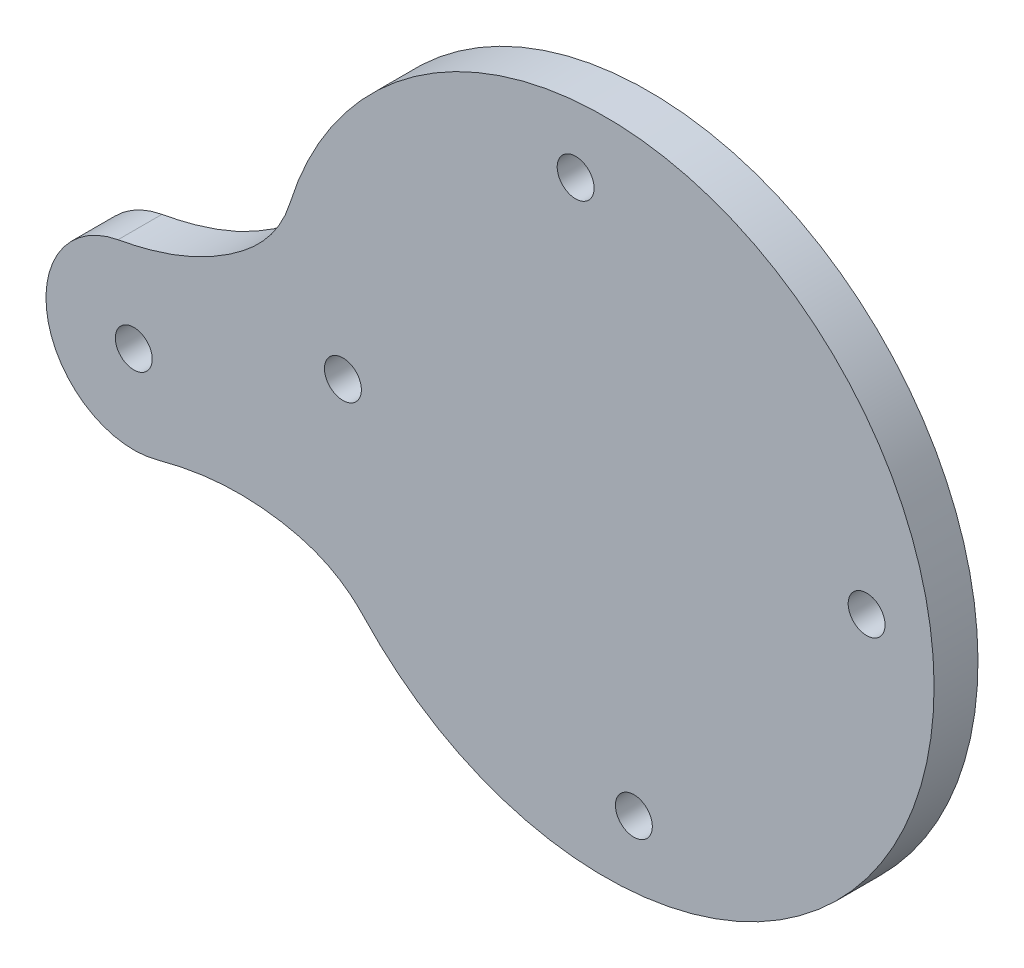
ISO-10303-21;
HEADER;
FILE_DESCRIPTION(('STEP AP214'),'2;1');
FILE_NAME('part.step','',(''),(''),'','','');
FILE_SCHEMA(('AUTOMOTIVE_DESIGN { 1 0 10303 214 1 1 1 1 }'));
ENDSEC;
DATA;
#1=APPLICATION_CONTEXT('core data for automotive mechanical design processes');
#2=APPLICATION_PROTOCOL_DEFINITION('international standard','automotive_design',2000,#1);
#3=PRODUCT_CONTEXT('',#1,'mechanical');
#4=PRODUCT('Part','Part','',(#3));
#5=PRODUCT_RELATED_PRODUCT_CATEGORY('part','',(#4));
#6=PRODUCT_DEFINITION_FORMATION('','',#4);
#7=PRODUCT_DEFINITION_CONTEXT('part definition',#1,'design');
#8=PRODUCT_DEFINITION('design','',#6,#7);
#9=PRODUCT_DEFINITION_SHAPE('','',#8);
#10=(LENGTH_UNIT() NAMED_UNIT(*) SI_UNIT(.MILLI.,.METRE.));
#11=(NAMED_UNIT(*) PLANE_ANGLE_UNIT() SI_UNIT($,.RADIAN.));
#12=(NAMED_UNIT(*) SI_UNIT($,.STERADIAN.) SOLID_ANGLE_UNIT());
#13=UNCERTAINTY_MEASURE_WITH_UNIT(LENGTH_MEASURE(1.E-05),#10,'distance_accuracy_value','');
#14=(GEOMETRIC_REPRESENTATION_CONTEXT(3) GLOBAL_UNCERTAINTY_ASSIGNED_CONTEXT((#13)) GLOBAL_UNIT_ASSIGNED_CONTEXT((#10,
#11,#12)) REPRESENTATION_CONTEXT('',''));
#15=CARTESIAN_POINT('',(0.,0.,0.));
#16=DIRECTION('',(0.,0.,1.));
#17=DIRECTION('',(1.,0.,0.));
#18=AXIS2_PLACEMENT_3D('',#15,#16,#17);
#19=CARTESIAN_POINT('',(0.,0.,5.));
#20=DIRECTION('',(0.,0.,-1.));
#21=DIRECTION('',(-1.,0.,0.));
#22=AXIS2_PLACEMENT_3D('',#19,#20,#21);
#23=CYLINDRICAL_SURFACE('',#22,37.5);
#24=DIRECTION('',(0.,0.,1.));
#25=VECTOR('',#24,1.);
#26=CARTESIAN_POINT('',(-27.4789036897266,-25.5178339992001,0.));
#27=LINE('',#26,#25);
#28=CARTESIAN_POINT('',(-27.4789036897266,-25.5178339992001,0.));
#29=VERTEX_POINT('',#28);
#30=CARTESIAN_POINT('',(-27.4789036897266,-25.5178339992001,5.));
#31=VERTEX_POINT('',#30);
#32=EDGE_CURVE('E77',#29,#31,#27,.T.);
#33=ORIENTED_EDGE('',*,*,#32,.F.);
#34=CARTESIAN_POINT('',(0.,0.,0.));
#35=DIRECTION('',(0.,0.,1.));
#36=DIRECTION('',(1.,0.,0.));
#37=AXIS2_PLACEMENT_3D('',#34,#35,#36);
#38=CIRCLE('',#37,37.5);
#39=CARTESIAN_POINT('',(-35.8163197815048,11.1104112124166,0.));
#40=VERTEX_POINT('',#39);
#41=EDGE_CURVE('E35',#29,#40,#38,.T.);
#42=ORIENTED_EDGE('',*,*,#41,.T.);
#43=DIRECTION('',(0.,0.,1.));
#44=VECTOR('',#43,1.);
#45=CARTESIAN_POINT('',(-35.8163197815048,11.1104112124166,0.));
#46=LINE('',#45,#44);
#47=CARTESIAN_POINT('',(-35.8163197815048,11.1104112124166,5.));
#48=VERTEX_POINT('',#47);
#49=EDGE_CURVE('E49',#40,#48,#46,.T.);
#50=ORIENTED_EDGE('',*,*,#49,.T.);
#51=CARTESIAN_POINT('',(0.,0.,5.));
#52=DIRECTION('',(0.,0.,1.));
#53=DIRECTION('',(1.,0.,0.));
#54=AXIS2_PLACEMENT_3D('',#51,#52,#53);
#55=CIRCLE('',#54,37.5);
#56=EDGE_CURVE('E11',#31,#48,#55,.T.);
#57=ORIENTED_EDGE('',*,*,#56,.F.);
#58=EDGE_LOOP('',(#33,#42,#50,#57));
#59=FACE_BOUND('',#58,.T.);
#60=ADVANCED_FACE('F32',(#59),#23,.T.);
#61=CARTESIAN_POINT('',(0.,0.,5.));
#62=DIRECTION('',(0.,0.,1.));
#63=DIRECTION('',(1.,0.,0.));
#64=AXIS2_PLACEMENT_3D('',#61,#62,#63);
#65=PLANE('',#64);
#66=CARTESIAN_POINT('',(-53.6282493156237,-12.2070010789425,5.));
#67=DIRECTION('',(0.,0.,1.));
#68=DIRECTION('',(1.,0.,0.));
#69=AXIS2_PLACEMENT_3D('',#66,#67,#68);
#70=CIRCLE('',#69,2.09999999999998);
#71=CARTESIAN_POINT('',(-51.5282493156237,-12.2070010789425,5.));
#72=VERTEX_POINT('',#71);
#73=EDGE_CURVE('E278',#72,#72,#70,.T.);
#74=ORIENTED_EDGE('',*,*,#73,.F.);
#75=EDGE_LOOP('',(#74));
#76=FACE_BOUND('',#75,.T.);
#77=CARTESIAN_POINT('',(-29.8161425951503,-3.31626910030909,5.));
#78=DIRECTION('',(0.,0.,1.));
#79=DIRECTION('',(1.,0.,0.));
#80=AXIS2_PLACEMENT_3D('',#77,#78,#79);
#81=CIRCLE('',#80,2.09999999999999);
#82=CARTESIAN_POINT('',(-27.7161425951503,-3.31626910030909,5.));
#83=VERTEX_POINT('',#82);
#84=EDGE_CURVE('E232',#83,#83,#81,.T.);
#85=ORIENTED_EDGE('',*,*,#84,.F.);
#86=EDGE_LOOP('',(#85));
#87=FACE_BOUND('',#86,.T.);
#88=CARTESIAN_POINT('',(-3.31626910030878,29.8161425951503,5.));
#89=DIRECTION('',(0.,0.,1.));
#90=DIRECTION('',(1.,0.,0.));
#91=AXIS2_PLACEMENT_3D('',#88,#89,#90);
#92=CIRCLE('',#91,2.09999999999999);
#93=CARTESIAN_POINT('',(-1.21626910030879,29.8161425951503,5.));
#94=VERTEX_POINT('',#93);
#95=EDGE_CURVE('E240',#94,#94,#92,.T.);
#96=ORIENTED_EDGE('',*,*,#95,.F.);
#97=EDGE_LOOP('',(#96));
#98=FACE_BOUND('',#97,.T.);
#99=CARTESIAN_POINT('',(29.8161425951503,3.31626910030889,5.));
#100=DIRECTION('',(0.,0.,1.));
#101=DIRECTION('',(1.,0.,0.));
#102=AXIS2_PLACEMENT_3D('',#99,#100,#101);
#103=CIRCLE('',#102,2.09999999999999);
#104=CARTESIAN_POINT('',(31.9161425951503,3.31626910030889,5.));
#105=VERTEX_POINT('',#104);
#106=EDGE_CURVE('E246',#105,#105,#103,.T.);
#107=ORIENTED_EDGE('',*,*,#106,.F.);
#108=EDGE_LOOP('',(#107));
#109=FACE_BOUND('',#108,.T.);
#110=CARTESIAN_POINT('',(3.31626910030878,-29.8161425951503,5.));
#111=DIRECTION('',(0.,0.,1.));
#112=DIRECTION('',(1.,0.,0.));
#113=AXIS2_PLACEMENT_3D('',#110,#111,#112);
#114=CIRCLE('',#113,2.09999999999999);
#115=CARTESIAN_POINT('',(5.41626910030877,-29.8161425951503,5.));
#116=VERTEX_POINT('',#115);
#117=EDGE_CURVE('E252',#116,#116,#114,.T.);
#118=ORIENTED_EDGE('',*,*,#117,.F.);
#119=EDGE_LOOP('',(#118));
#120=FACE_BOUND('',#119,.T.);
#121=ORIENTED_EDGE('',*,*,#56,.T.);
#122=CARTESIAN_POINT('',(-35.8163197815048,11.1104112124166,5.));
#123=CARTESIAN_POINT('',(-37.0525345050911,7.12526061699192,5.));
#124=CARTESIAN_POINT('',(-43.1517290942981,1.30950198413376,5.));
#125=CARTESIAN_POINT('',(-50.5138543218179,-1.47132829080098,5.));
#126=CARTESIAN_POINT('',(-55.4277211405371,-2.37023834157088,5.));
#127=B_SPLINE_CURVE_WITH_KNOTS('',3,(#122,#123,#124,#125,#126),.UNSPECIFIED.,.F.,.F.,(4,1,4),
(0.,0.450210397088935,1.),.UNSPECIFIED.);
#128=CARTESIAN_POINT('',(-55.4277211405371,-2.37023834157088,5.));
#129=VERTEX_POINT('',#128);
#130=EDGE_CURVE('E89',#48,#129,#127,.T.);
#131=ORIENTED_EDGE('',*,*,#130,.T.);
#132=CARTESIAN_POINT('',(-53.6282493156237,-12.2070010789425,5.));
#133=DIRECTION('',(0.,0.,1.));
#134=DIRECTION('',(1.,0.,0.));
#135=AXIS2_PLACEMENT_3D('',#132,#133,#134);
#136=CIRCLE('',#135,10.);
#137=CARTESIAN_POINT('',(-50.992891264917,-21.8534972275228,5.));
#138=VERTEX_POINT('',#137);
#139=EDGE_CURVE('E85',#129,#138,#136,.T.);
#140=ORIENTED_EDGE('',*,*,#139,.T.);
#141=CARTESIAN_POINT('',(-50.992891264917,-21.8534972275228,5.));
#142=CARTESIAN_POINT('',(-46.1740704183671,-20.5370276910956,5.));
#143=CARTESIAN_POINT('',(-38.3336600489529,-19.8574174183213,5.));
#144=CARTESIAN_POINT('',(-30.3181795275633,-22.460357126401,5.));
#145=CARTESIAN_POINT('',(-27.4789036897265,-25.5178339992001,5.));
#146=B_SPLINE_CURVE_WITH_KNOTS('',3,(#141,#142,#143,#144,#145),.UNSPECIFIED.,.F.,.F.,(4,1,4),
(0.,0.549789602911066,1.),.UNSPECIFIED.);
#147=EDGE_CURVE('E219',#138,#31,#146,.T.);
#148=ORIENTED_EDGE('',*,*,#147,.T.);
#149=EDGE_LOOP('',(#121,#131,#140,#148));
#150=FACE_BOUND('',#149,.T.);
#151=ADVANCED_FACE('F127',(#76,#87,#98,#109,#120,#150),#65,.T.);
#152=CARTESIAN_POINT('',(0.,0.,0.));
#153=DIRECTION('',(0.,0.,1.));
#154=DIRECTION('',(1.,0.,0.));
#155=AXIS2_PLACEMENT_3D('',#152,#153,#154);
#156=PLANE('',#155);
#157=CARTESIAN_POINT('',(-53.6282493156237,-12.2070010789425,0.));
#158=DIRECTION('',(0.,0.,1.));
#159=DIRECTION('',(1.,0.,0.));
#160=AXIS2_PLACEMENT_3D('',#157,#158,#159);
#161=CIRCLE('',#160,2.1);
#162=CARTESIAN_POINT('',(-51.5282493156237,-12.2070010789425,0.));
#163=VERTEX_POINT('',#162);
#164=EDGE_CURVE('E95',#163,#163,#161,.T.);
#165=ORIENTED_EDGE('',*,*,#164,.T.);
#166=EDGE_LOOP('',(#165));
#167=FACE_BOUND('',#166,.T.);
#168=CARTESIAN_POINT('',(-29.8161425951503,-3.31626910030909,0.));
#169=DIRECTION('',(0.,0.,1.));
#170=DIRECTION('',(1.,0.,0.));
#171=AXIS2_PLACEMENT_3D('',#168,#169,#170);
#172=CIRCLE('',#171,2.1);
#173=CARTESIAN_POINT('',(-27.7161425951503,-3.31626910030909,0.));
#174=VERTEX_POINT('',#173);
#175=EDGE_CURVE('E237',#174,#174,#172,.T.);
#176=ORIENTED_EDGE('',*,*,#175,.T.);
#177=EDGE_LOOP('',(#176));
#178=FACE_BOUND('',#177,.T.);
#179=CARTESIAN_POINT('',(-3.31626910030878,29.8161425951503,0.));
#180=DIRECTION('',(0.,0.,1.));
#181=DIRECTION('',(1.,0.,0.));
#182=AXIS2_PLACEMENT_3D('',#179,#180,#181);
#183=CIRCLE('',#182,2.1);
#184=CARTESIAN_POINT('',(-1.21626910030878,29.8161425951503,0.));
#185=VERTEX_POINT('',#184);
#186=EDGE_CURVE('E243',#185,#185,#183,.T.);
#187=ORIENTED_EDGE('',*,*,#186,.T.);
#188=EDGE_LOOP('',(#187));
#189=FACE_BOUND('',#188,.T.);
#190=CARTESIAN_POINT('',(29.8161425951503,3.31626910030889,0.));
#191=DIRECTION('',(0.,0.,1.));
#192=DIRECTION('',(1.,0.,0.));
#193=AXIS2_PLACEMENT_3D('',#190,#191,#192);
#194=CIRCLE('',#193,2.1);
#195=CARTESIAN_POINT('',(31.9161425951503,3.31626910030889,0.));
#196=VERTEX_POINT('',#195);
#197=EDGE_CURVE('E249',#196,#196,#194,.T.);
#198=ORIENTED_EDGE('',*,*,#197,.T.);
#199=EDGE_LOOP('',(#198));
#200=FACE_BOUND('',#199,.T.);
#201=CARTESIAN_POINT('',(3.31626910030878,-29.8161425951503,0.));
#202=DIRECTION('',(0.,0.,1.));
#203=DIRECTION('',(1.,0.,0.));
#204=AXIS2_PLACEMENT_3D('',#201,#202,#203);
#205=CIRCLE('',#204,2.1);
#206=CARTESIAN_POINT('',(5.41626910030878,-29.8161425951503,0.));
#207=VERTEX_POINT('',#206);
#208=EDGE_CURVE('E76',#207,#207,#205,.T.);
#209=ORIENTED_EDGE('',*,*,#208,.T.);
#210=EDGE_LOOP('',(#209));
#211=FACE_BOUND('',#210,.T.);
#212=ORIENTED_EDGE('',*,*,#41,.F.);
#213=CARTESIAN_POINT('',(-50.992891264917,-21.8534972275228,0.));
#214=CARTESIAN_POINT('',(-46.1740704183671,-20.5370276910956,0.));
#215=CARTESIAN_POINT('',(-38.3336600489529,-19.8574174183213,0.));
#216=CARTESIAN_POINT('',(-30.3181795275633,-22.460357126401,0.));
#217=CARTESIAN_POINT('',(-27.4789036897265,-25.5178339992001,0.));
#218=B_SPLINE_CURVE_WITH_KNOTS('',3,(#213,#214,#215,#216,#217),.UNSPECIFIED.,.F.,.F.,(4,1,4),
(0.,0.549789602911066,1.),.UNSPECIFIED.);
#219=CARTESIAN_POINT('',(-50.992891264917,-21.8534972275228,0.));
#220=VERTEX_POINT('',#219);
#221=EDGE_CURVE('E72',#220,#29,#218,.T.);
#222=ORIENTED_EDGE('',*,*,#221,.F.);
#223=CARTESIAN_POINT('',(-53.6282493156237,-12.2070010789425,0.));
#224=DIRECTION('',(0.,0.,1.));
#225=DIRECTION('',(1.,0.,0.));
#226=AXIS2_PLACEMENT_3D('',#223,#224,#225);
#227=CIRCLE('',#226,10.);
#228=CARTESIAN_POINT('',(-55.4277211405371,-2.37023834157088,0.));
#229=VERTEX_POINT('',#228);
#230=EDGE_CURVE('E81',#229,#220,#227,.T.);
#231=ORIENTED_EDGE('',*,*,#230,.F.);
#232=CARTESIAN_POINT('',(-35.8163197815048,11.1104112124166,0.));
#233=CARTESIAN_POINT('',(-37.0525345050911,7.12526061699192,0.));
#234=CARTESIAN_POINT('',(-43.1517290942981,1.30950198413376,0.));
#235=CARTESIAN_POINT('',(-50.5138543218179,-1.47132829080098,0.));
#236=CARTESIAN_POINT('',(-55.4277211405371,-2.37023834157088,0.));
#237=B_SPLINE_CURVE_WITH_KNOTS('',3,(#232,#233,#234,#235,#236),.UNSPECIFIED.,.F.,.F.,(4,1,4),
(0.,0.450210397088935,1.),.UNSPECIFIED.);
#238=EDGE_CURVE('E75',#40,#229,#237,.T.);
#239=ORIENTED_EDGE('',*,*,#238,.F.);
#240=EDGE_LOOP('',(#212,#222,#231,#239));
#241=FACE_BOUND('',#240,.T.);
#242=ADVANCED_FACE('F69',(#167,#178,#189,#200,#211,#241),#156,.F.);
#243=CARTESIAN_POINT('',(3.31626910030878,-29.8161425951503,5.));
#244=DIRECTION('',(0.,0.,1.));
#245=DIRECTION('',(1.,0.,0.));
#246=AXIS2_PLACEMENT_3D('',#243,#244,#245);
#247=CYLINDRICAL_SURFACE('',#246,2.09999999999999);
#248=ORIENTED_EDGE('',*,*,#208,.F.);
#249=EDGE_LOOP('',(#248));
#250=FACE_BOUND('',#249,.T.);
#251=ORIENTED_EDGE('',*,*,#117,.T.);
#252=EDGE_LOOP('',(#251));
#253=FACE_BOUND('',#252,.T.);
#254=ADVANCED_FACE('F122',(#250,#253),#247,.F.);
#255=CARTESIAN_POINT('',(29.8161425951503,3.31626910030889,5.));
#256=DIRECTION('',(0.,0.,1.));
#257=DIRECTION('',(1.,0.,0.));
#258=AXIS2_PLACEMENT_3D('',#255,#256,#257);
#259=CYLINDRICAL_SURFACE('',#258,2.09999999999999);
#260=ORIENTED_EDGE('',*,*,#197,.F.);
#261=EDGE_LOOP('',(#260));
#262=FACE_BOUND('',#261,.T.);
#263=ORIENTED_EDGE('',*,*,#106,.T.);
#264=EDGE_LOOP('',(#263));
#265=FACE_BOUND('',#264,.T.);
#266=ADVANCED_FACE('F118',(#262,#265),#259,.F.);
#267=CARTESIAN_POINT('',(-3.31626910030878,29.8161425951503,5.));
#268=DIRECTION('',(0.,0.,1.));
#269=DIRECTION('',(1.,0.,0.));
#270=AXIS2_PLACEMENT_3D('',#267,#268,#269);
#271=CYLINDRICAL_SURFACE('',#270,2.09999999999999);
#272=ORIENTED_EDGE('',*,*,#186,.F.);
#273=EDGE_LOOP('',(#272));
#274=FACE_BOUND('',#273,.T.);
#275=ORIENTED_EDGE('',*,*,#95,.T.);
#276=EDGE_LOOP('',(#275));
#277=FACE_BOUND('',#276,.T.);
#278=ADVANCED_FACE('F114',(#274,#277),#271,.F.);
#279=CARTESIAN_POINT('',(-29.8161425951503,-3.31626910030909,5.));
#280=DIRECTION('',(0.,0.,1.));
#281=DIRECTION('',(1.,0.,0.));
#282=AXIS2_PLACEMENT_3D('',#279,#280,#281);
#283=CYLINDRICAL_SURFACE('',#282,2.09999999999999);
#284=ORIENTED_EDGE('',*,*,#175,.F.);
#285=EDGE_LOOP('',(#284));
#286=FACE_BOUND('',#285,.T.);
#287=ORIENTED_EDGE('',*,*,#84,.T.);
#288=EDGE_LOOP('',(#287));
#289=FACE_BOUND('',#288,.T.);
#290=ADVANCED_FACE('F109',(#286,#289),#283,.F.);
#291=DIRECTION('',(0.,0.,1.));
#292=VECTOR('',#291,1.);
#293=SURFACE_OF_LINEAR_EXTRUSION('',#218,#292);
#294=ORIENTED_EDGE('',*,*,#147,.F.);
#295=DIRECTION('',(0.,0.,1.));
#296=VECTOR('',#295,1.);
#297=CARTESIAN_POINT('',(-50.992891264917,-21.8534972275228,0.));
#298=LINE('',#297,#296);
#299=EDGE_CURVE('E84',#220,#138,#298,.T.);
#300=ORIENTED_EDGE('',*,*,#299,.F.);
#301=ORIENTED_EDGE('',*,*,#221,.T.);
#302=ORIENTED_EDGE('',*,*,#32,.T.);
#303=EDGE_LOOP('',(#294,#300,#301,#302));
#304=FACE_BOUND('',#303,.T.);
#305=ADVANCED_FACE('F83',(#304),#293,.T.);
#306=CARTESIAN_POINT('',(-53.6282493156237,-12.2070010789425,0.));
#307=DIRECTION('',(0.,0.,1.));
#308=DIRECTION('',(1.,0.,0.));
#309=AXIS2_PLACEMENT_3D('',#306,#307,#308);
#310=CYLINDRICAL_SURFACE('',#309,10.);
#311=ORIENTED_EDGE('',*,*,#139,.F.);
#312=DIRECTION('',(0.,0.,1.));
#313=VECTOR('',#312,1.);
#314=CARTESIAN_POINT('',(-55.4277211405371,-2.37023834157088,0.));
#315=LINE('',#314,#313);
#316=EDGE_CURVE('E216',#229,#129,#315,.T.);
#317=ORIENTED_EDGE('',*,*,#316,.F.);
#318=ORIENTED_EDGE('',*,*,#230,.T.);
#319=ORIENTED_EDGE('',*,*,#299,.T.);
#320=EDGE_LOOP('',(#311,#317,#318,#319));
#321=FACE_BOUND('',#320,.T.);
#322=ADVANCED_FACE('F108',(#321),#310,.T.);
#323=DIRECTION('',(0.,0.,1.));
#324=VECTOR('',#323,1.);
#325=SURFACE_OF_LINEAR_EXTRUSION('',#237,#324);
#326=ORIENTED_EDGE('',*,*,#130,.F.);
#327=ORIENTED_EDGE('',*,*,#49,.F.);
#328=ORIENTED_EDGE('',*,*,#238,.T.);
#329=ORIENTED_EDGE('',*,*,#316,.T.);
#330=EDGE_LOOP('',(#326,#327,#328,#329));
#331=FACE_BOUND('',#330,.T.);
#332=ADVANCED_FACE('F110',(#331),#325,.T.);
#333=CARTESIAN_POINT('',(-53.6282493156237,-12.2070010789425,5.));
#334=DIRECTION('',(0.,0.,1.));
#335=DIRECTION('',(1.,0.,0.));
#336=AXIS2_PLACEMENT_3D('',#333,#334,#335);
#337=CYLINDRICAL_SURFACE('',#336,2.09999999999999);
#338=ORIENTED_EDGE('',*,*,#164,.F.);
#339=EDGE_LOOP('',(#338));
#340=FACE_BOUND('',#339,.T.);
#341=ORIENTED_EDGE('',*,*,#73,.T.);
#342=EDGE_LOOP('',(#341));
#343=FACE_BOUND('',#342,.T.);
#344=ADVANCED_FACE('F162',(#340,#343),#337,.F.);
#345=CLOSED_SHELL('',(#60,#151,#242,#254,#266,#278,#290,#305,#322,#332,#344));
#346=MANIFOLD_SOLID_BREP('B2',#345);
#347=ADVANCED_BREP_SHAPE_REPRESENTATION('',(#18,#346),#14);
#348=SHAPE_DEFINITION_REPRESENTATION(#9,#347);
ENDSEC;
END-ISO-10303-21;
